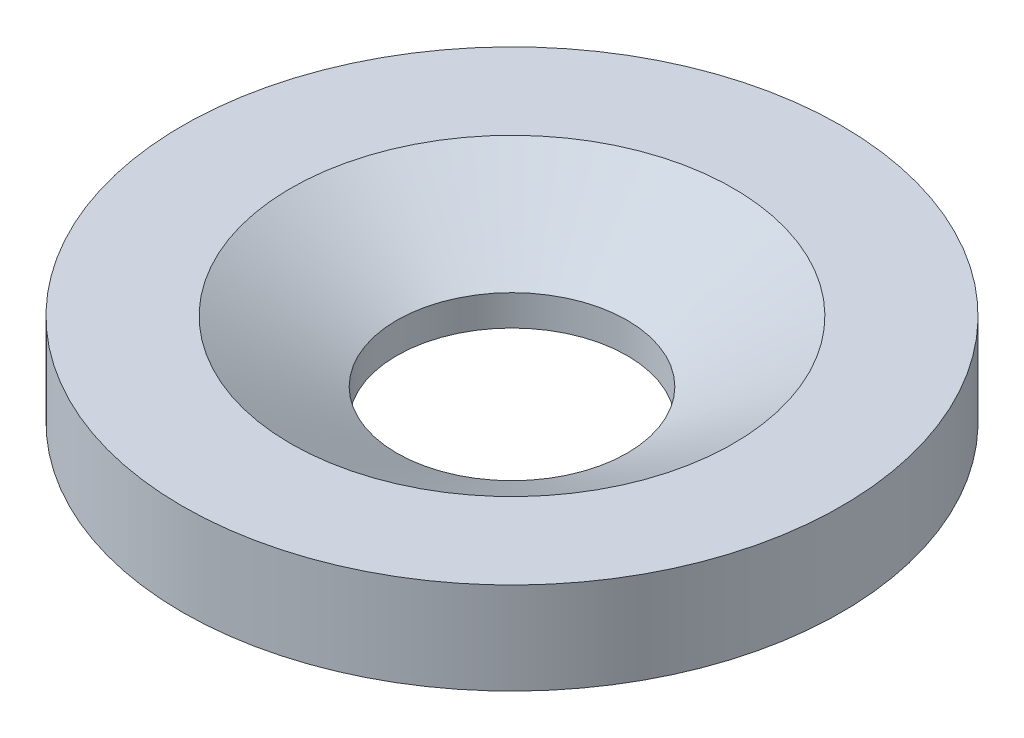
ISO-10303-21;
HEADER;
FILE_DESCRIPTION(('STEP AP214'),'2;1');
FILE_NAME('part.step','',(''),(''),'','','');
FILE_SCHEMA(('AUTOMOTIVE_DESIGN { 1 0 10303 214 1 1 1 1 }'));
ENDSEC;
DATA;
#1=APPLICATION_CONTEXT('core data for automotive mechanical design processes');
#2=APPLICATION_PROTOCOL_DEFINITION('international standard','automotive_design',2000,#1);
#3=PRODUCT_CONTEXT('',#1,'mechanical');
#4=PRODUCT('Part','Part','',(#3));
#5=PRODUCT_RELATED_PRODUCT_CATEGORY('part','',(#4));
#6=PRODUCT_DEFINITION_FORMATION('','',#4);
#7=PRODUCT_DEFINITION_CONTEXT('part definition',#1,'design');
#8=PRODUCT_DEFINITION('design','',#6,#7);
#9=PRODUCT_DEFINITION_SHAPE('','',#8);
#10=(LENGTH_UNIT() NAMED_UNIT(*) SI_UNIT(.MILLI.,.METRE.));
#11=(NAMED_UNIT(*) PLANE_ANGLE_UNIT() SI_UNIT($,.RADIAN.));
#12=(NAMED_UNIT(*) SI_UNIT($,.STERADIAN.) SOLID_ANGLE_UNIT());
#13=UNCERTAINTY_MEASURE_WITH_UNIT(LENGTH_MEASURE(1.E-05),#10,'distance_accuracy_value','');
#14=(GEOMETRIC_REPRESENTATION_CONTEXT(3) GLOBAL_UNCERTAINTY_ASSIGNED_CONTEXT((#13)) GLOBAL_UNIT_ASSIGNED_CONTEXT((#10,
#11,#12)) REPRESENTATION_CONTEXT('',''));
#15=CARTESIAN_POINT('',(0.,0.,0.));
#16=DIRECTION('',(0.,0.,1.));
#17=DIRECTION('',(1.,0.,0.));
#18=AXIS2_PLACEMENT_3D('',#15,#16,#17);
#19=CARTESIAN_POINT('',(47.752,0.,0.));
#20=DIRECTION('',(0.,1.,0.));
#21=DIRECTION('',(0.,0.,1.));
#22=AXIS2_PLACEMENT_3D('',#19,#20,#21);
#23=PLANE('',#22);
#24=CARTESIAN_POINT('',(0.,0.,0.));
#25=DIRECTION('',(0.,1.,0.));
#26=DIRECTION('',(0.,0.,1.));
#27=AXIS2_PLACEMENT_3D('',#24,#25,#26);
#28=CIRCLE('',#27,136.652);
#29=CARTESIAN_POINT('',(0.,0.,136.652));
#30=VERTEX_POINT('',#29);
#31=EDGE_CURVE('E10',#30,#30,#28,.T.);
#32=ORIENTED_EDGE('',*,*,#31,.F.);
#33=EDGE_LOOP('',(#32));
#34=FACE_BOUND('',#33,.T.);
#35=CARTESIAN_POINT('',(0.,0.,0.));
#36=DIRECTION('',(0.,1.,0.));
#37=DIRECTION('',(0.,0.,1.));
#38=AXIS2_PLACEMENT_3D('',#35,#36,#37);
#39=CIRCLE('',#38,47.752);
#40=CARTESIAN_POINT('',(0.,0.,47.752));
#41=VERTEX_POINT('',#40);
#42=EDGE_CURVE('E50',#41,#41,#39,.T.);
#43=ORIENTED_EDGE('',*,*,#42,.T.);
#44=EDGE_LOOP('',(#43));
#45=FACE_BOUND('',#44,.T.);
#46=ADVANCED_FACE('F31',(#34,#45),#23,.F.);
#47=CARTESIAN_POINT('',(0.,36.5441304233678,0.));
#48=DIRECTION('',(0.,1.,0.));
#49=DIRECTION('',(0.,0.,1.));
#50=AXIS2_PLACEMENT_3D('',#47,#48,#49);
#51=CYLINDRICAL_SURFACE('',#50,136.652);
#52=CARTESIAN_POINT('',(0.,38.1,0.));
#53=DIRECTION('',(0.,1.,0.));
#54=DIRECTION('',(0.,0.,1.));
#55=AXIS2_PLACEMENT_3D('',#52,#53,#54);
#56=CIRCLE('',#55,136.652);
#57=CARTESIAN_POINT('',(0.,38.1,136.652));
#58=VERTEX_POINT('',#57);
#59=EDGE_CURVE('E37',#58,#58,#56,.T.);
#60=ORIENTED_EDGE('',*,*,#59,.F.);
#61=EDGE_LOOP('',(#60));
#62=FACE_BOUND('',#61,.T.);
#63=ORIENTED_EDGE('',*,*,#31,.T.);
#64=EDGE_LOOP('',(#63));
#65=FACE_BOUND('',#64,.T.);
#66=ADVANCED_FACE('F69',(#62,#65),#51,.T.);
#67=CARTESIAN_POINT('',(91.7460905122501,38.1,0.));
#68=DIRECTION('',(0.,-1.,0.));
#69=DIRECTION('',(0.,0.,-1.));
#70=AXIS2_PLACEMENT_3D('',#67,#68,#69);
#71=PLANE('',#70);
#72=CARTESIAN_POINT('',(0.,38.1,0.));
#73=DIRECTION('',(0.,1.,0.));
#74=DIRECTION('',(0.,0.,1.));
#75=AXIS2_PLACEMENT_3D('',#72,#73,#74);
#76=CIRCLE('',#75,91.7460905122501);
#77=CARTESIAN_POINT('',(0.,38.1,91.7460905122501));
#78=VERTEX_POINT('',#77);
#79=EDGE_CURVE('E41',#78,#78,#76,.T.);
#80=ORIENTED_EDGE('',*,*,#79,.F.);
#81=EDGE_LOOP('',(#80));
#82=FACE_BOUND('',#81,.T.);
#83=ORIENTED_EDGE('',*,*,#59,.T.);
#84=EDGE_LOOP('',(#83));
#85=FACE_BOUND('',#84,.T.);
#86=ADVANCED_FACE('F64',(#82,#85),#71,.F.);
#87=CARTESIAN_POINT('',(0.,38.1,0.));
#88=DIRECTION('',(0.,1.,0.));
#89=DIRECTION('',(0.,0.,1.));
#90=AXIS2_PLACEMENT_3D('',#87,#88,#89);
#91=CONICAL_SURFACE('',#90,91.7460905122501,1.0471975511966);
#92=CARTESIAN_POINT('',(0.,12.7,0.));
#93=DIRECTION('',(0.,1.,0.));
#94=DIRECTION('',(0.,0.,1.));
#95=AXIS2_PLACEMENT_3D('',#92,#93,#94);
#96=CIRCLE('',#95,47.752);
#97=CARTESIAN_POINT('',(0.,12.7,47.752));
#98=VERTEX_POINT('',#97);
#99=EDGE_CURVE('E45',#98,#98,#96,.T.);
#100=ORIENTED_EDGE('',*,*,#99,.F.);
#101=EDGE_LOOP('',(#100));
#102=FACE_BOUND('',#101,.T.);
#103=ORIENTED_EDGE('',*,*,#79,.T.);
#104=EDGE_LOOP('',(#103));
#105=FACE_BOUND('',#104,.T.);
#106=ADVANCED_FACE('F58',(#102,#105),#91,.F.);
#107=CARTESIAN_POINT('',(0.,36.5441304233678,0.));
#108=DIRECTION('',(0.,1.,0.));
#109=DIRECTION('',(0.,0.,1.));
#110=AXIS2_PLACEMENT_3D('',#107,#108,#109);
#111=CYLINDRICAL_SURFACE('',#110,47.752);
#112=ORIENTED_EDGE('',*,*,#42,.F.);
#113=EDGE_LOOP('',(#112));
#114=FACE_BOUND('',#113,.T.);
#115=ORIENTED_EDGE('',*,*,#99,.T.);
#116=EDGE_LOOP('',(#115));
#117=FACE_BOUND('',#116,.T.);
#118=ADVANCED_FACE('F55',(#114,#117),#111,.F.);
#119=CLOSED_SHELL('',(#46,#66,#86,#106,#118));
#120=MANIFOLD_SOLID_BREP('B2',#119);
#121=ADVANCED_BREP_SHAPE_REPRESENTATION('',(#18,#120),#14);
#122=SHAPE_DEFINITION_REPRESENTATION(#9,#121);
ENDSEC;
END-ISO-10303-21;
